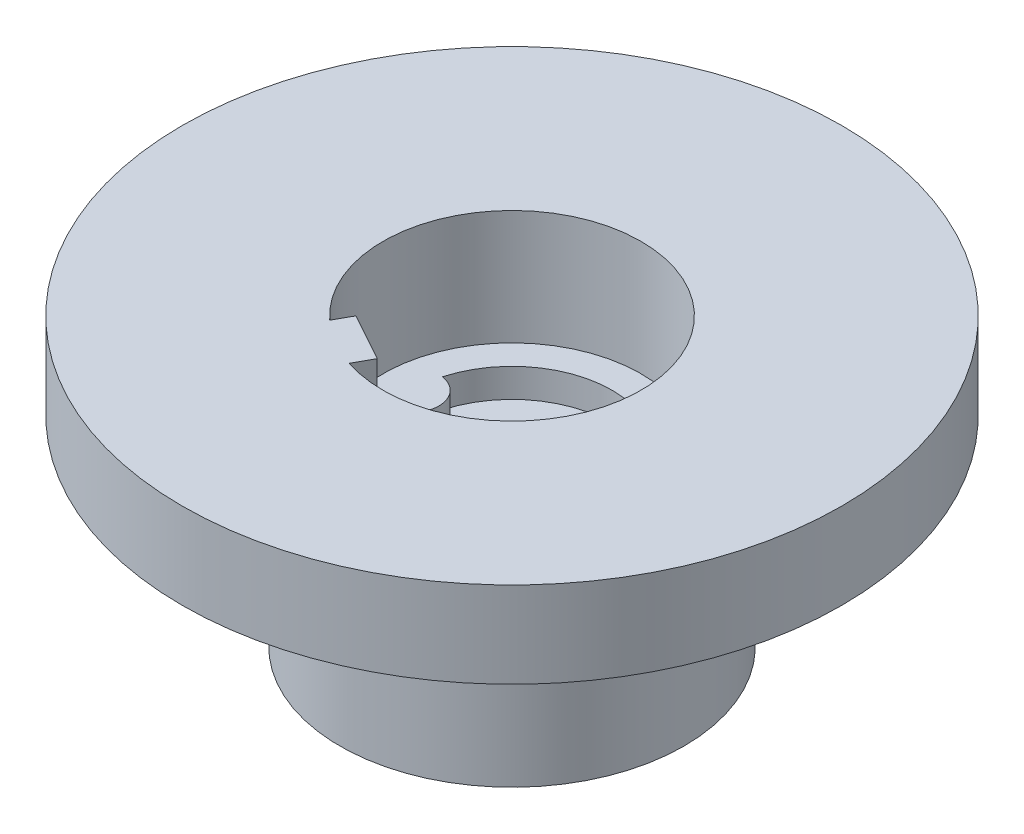
ISO-10303-21;
HEADER;
FILE_DESCRIPTION(('STEP AP214'),'2;1');
FILE_NAME('part.step','',(''),(''),'','','');
FILE_SCHEMA(('AUTOMOTIVE_DESIGN { 1 0 10303 214 1 1 1 1 }'));
ENDSEC;
DATA;
#1=APPLICATION_CONTEXT('core data for automotive mechanical design processes');
#2=APPLICATION_PROTOCOL_DEFINITION('international standard','automotive_design',2000,#1);
#3=PRODUCT_CONTEXT('',#1,'mechanical');
#4=PRODUCT('Part','Part','',(#3));
#5=PRODUCT_RELATED_PRODUCT_CATEGORY('part','',(#4));
#6=PRODUCT_DEFINITION_FORMATION('','',#4);
#7=PRODUCT_DEFINITION_CONTEXT('part definition',#1,'design');
#8=PRODUCT_DEFINITION('design','',#6,#7);
#9=PRODUCT_DEFINITION_SHAPE('','',#8);
#10=(LENGTH_UNIT() NAMED_UNIT(*) SI_UNIT(.MILLI.,.METRE.));
#11=(NAMED_UNIT(*) PLANE_ANGLE_UNIT() SI_UNIT($,.RADIAN.));
#12=(NAMED_UNIT(*) SI_UNIT($,.STERADIAN.) SOLID_ANGLE_UNIT());
#13=UNCERTAINTY_MEASURE_WITH_UNIT(LENGTH_MEASURE(1.E-05),#10,'distance_accuracy_value','');
#14=(GEOMETRIC_REPRESENTATION_CONTEXT(3) GLOBAL_UNCERTAINTY_ASSIGNED_CONTEXT((#13)) GLOBAL_UNIT_ASSIGNED_CONTEXT((#10,
#11,#12)) REPRESENTATION_CONTEXT('',''));
#15=CARTESIAN_POINT('',(0.,0.,0.));
#16=DIRECTION('',(0.,0.,1.));
#17=DIRECTION('',(1.,0.,0.));
#18=AXIS2_PLACEMENT_3D('',#15,#16,#17);
#19=CARTESIAN_POINT('',(0.,0.,0.));
#20=DIRECTION('',(0.,1.,0.));
#21=DIRECTION('',(1.,0.,0.));
#22=AXIS2_PLACEMENT_3D('',#19,#20,#21);
#23=CYLINDRICAL_SURFACE('',#22,3.5);
#24=CARTESIAN_POINT('',(0.,0.,0.));
#25=DIRECTION('',(0.,-1.,0.));
#26=DIRECTION('',(1.,0.,0.));
#27=AXIS2_PLACEMENT_3D('',#24,#25,#26);
#28=CIRCLE('',#27,3.5);
#29=CARTESIAN_POINT('',(2.50064801796052,0.,-2.44882818716833));
#30=VERTEX_POINT('',#29);
#31=CARTESIAN_POINT('',(2.50064801796051,0.,2.44882818716833));
#32=VERTEX_POINT('',#31);
#33=EDGE_CURVE('E203',#30,#32,#28,.T.);
#34=ORIENTED_EDGE('',*,*,#33,.T.);
#35=DIRECTION('',(0.,1.,0.));
#36=VECTOR('',#35,1.);
#37=CARTESIAN_POINT('',(2.50064801796051,0.,2.44882818716833));
#38=LINE('',#37,#36);
#39=CARTESIAN_POINT('',(2.50064801796051,1.,2.44882818716833));
#40=VERTEX_POINT('',#39);
#41=EDGE_CURVE('E11',#32,#40,#38,.T.);
#42=ORIENTED_EDGE('',*,*,#41,.T.);
#43=CARTESIAN_POINT('',(0.,1.,0.));
#44=DIRECTION('',(0.,-1.,0.));
#45=DIRECTION('',(1.,0.,0.));
#46=AXIS2_PLACEMENT_3D('',#43,#44,#45);
#47=CIRCLE('',#46,3.5);
#48=CARTESIAN_POINT('',(2.50064801796052,1.,-2.44882818716833));
#49=VERTEX_POINT('',#48);
#50=EDGE_CURVE('E176',#49,#40,#47,.T.);
#51=ORIENTED_EDGE('',*,*,#50,.F.);
#52=DIRECTION('',(0.,1.,0.));
#53=VECTOR('',#52,1.);
#54=CARTESIAN_POINT('',(2.50064801796052,0.,-2.44882818716833));
#55=LINE('',#54,#53);
#56=EDGE_CURVE('E257',#30,#49,#55,.T.);
#57=ORIENTED_EDGE('',*,*,#56,.F.);
#58=EDGE_LOOP('',(#34,#42,#51,#57));
#59=FACE_BOUND('',#58,.T.);
#60=ADVANCED_FACE('F17',(#59),#23,.F.);
#61=CARTESIAN_POINT('',(1.75,0.,3.03108891324554));
#62=DIRECTION('',(0.,1.,0.));
#63=DIRECTION('',(-1.,0.,0.));
#64=AXIS2_PLACEMENT_3D('',#61,#62,#63);
#65=CYLINDRICAL_SURFACE('',#64,0.95);
#66=CARTESIAN_POINT('',(1.75,0.,3.03108891324554));
#67=DIRECTION('',(0.,1.,0.));
#68=DIRECTION('',(-1.,0.,0.));
#69=AXIS2_PLACEMENT_3D('',#66,#67,#68);
#70=CIRCLE('',#69,0.95);
#71=CARTESIAN_POINT('',(0.870423410610912,0.,3.39003880306118));
#72=VERTEX_POINT('',#71);
#73=EDGE_CURVE('E208',#32,#72,#70,.T.);
#74=ORIENTED_EDGE('',*,*,#73,.T.);
#75=DIRECTION('',(0.,1.,0.));
#76=VECTOR('',#75,1.);
#77=CARTESIAN_POINT('',(0.870423410610912,0.,3.39003880306118));
#78=LINE('',#77,#76);
#79=CARTESIAN_POINT('',(0.870423410610912,1.,3.39003880306118));
#80=VERTEX_POINT('',#79);
#81=EDGE_CURVE('E27',#72,#80,#78,.T.);
#82=ORIENTED_EDGE('',*,*,#81,.T.);
#83=CARTESIAN_POINT('',(1.75,1.,3.03108891324554));
#84=DIRECTION('',(0.,1.,0.));
#85=DIRECTION('',(-1.,0.,0.));
#86=AXIS2_PLACEMENT_3D('',#83,#84,#85);
#87=CIRCLE('',#86,0.95);
#88=EDGE_CURVE('E180',#40,#80,#87,.T.);
#89=ORIENTED_EDGE('',*,*,#88,.F.);
#90=ORIENTED_EDGE('',*,*,#41,.F.);
#91=EDGE_LOOP('',(#74,#82,#89,#90));
#92=FACE_BOUND('',#91,.T.);
#93=ADVANCED_FACE('F300',(#92),#65,.T.);
#94=CARTESIAN_POINT('',(0.,0.,0.));
#95=DIRECTION('',(0.,1.,0.));
#96=DIRECTION('',(1.,0.,0.));
#97=AXIS2_PLACEMENT_3D('',#94,#95,#96);
#98=CYLINDRICAL_SURFACE('',#97,3.5);
#99=CARTESIAN_POINT('',(0.,0.,0.));
#100=DIRECTION('',(0.,-1.,0.));
#101=DIRECTION('',(1.,0.,0.));
#102=AXIS2_PLACEMENT_3D('',#99,#100,#101);
#103=CIRCLE('',#102,3.5);
#104=CARTESIAN_POINT('',(-3.37107142857143,0.,0.941210615892844));
#105=VERTEX_POINT('',#104);
#106=EDGE_CURVE('E217',#72,#105,#103,.T.);
#107=ORIENTED_EDGE('',*,*,#106,.T.);
#108=DIRECTION('',(0.,1.,0.));
#109=VECTOR('',#108,1.);
#110=CARTESIAN_POINT('',(-3.37107142857143,0.,0.941210615892844));
#111=LINE('',#110,#109);
#112=CARTESIAN_POINT('',(-3.37107142857143,1.,0.941210615892844));
#113=VERTEX_POINT('',#112);
#114=EDGE_CURVE('E193',#105,#113,#111,.T.);
#115=ORIENTED_EDGE('',*,*,#114,.T.);
#116=CARTESIAN_POINT('',(0.,1.,0.));
#117=DIRECTION('',(0.,-1.,0.));
#118=DIRECTION('',(1.,0.,0.));
#119=AXIS2_PLACEMENT_3D('',#116,#117,#118);
#120=CIRCLE('',#119,3.5);
#121=EDGE_CURVE('E189',#80,#113,#120,.T.);
#122=ORIENTED_EDGE('',*,*,#121,.F.);
#123=ORIENTED_EDGE('',*,*,#81,.F.);
#124=EDGE_LOOP('',(#107,#115,#122,#123));
#125=FACE_BOUND('',#124,.T.);
#126=ADVANCED_FACE('F19',(#125),#98,.F.);
#127=CARTESIAN_POINT('',(-3.5,0.,0.));
#128=DIRECTION('',(0.,1.,0.));
#129=DIRECTION('',(1.,0.,0.));
#130=AXIS2_PLACEMENT_3D('',#127,#128,#129);
#131=CYLINDRICAL_SURFACE('',#130,0.95);
#132=CARTESIAN_POINT('',(-3.5,0.,0.));
#133=DIRECTION('',(0.,1.,0.));
#134=DIRECTION('',(-1.,0.,0.));
#135=AXIS2_PLACEMENT_3D('',#132,#133,#134);
#136=CIRCLE('',#135,0.95);
#137=CARTESIAN_POINT('',(-3.37107142857143,0.,-0.941210615892846));
#138=VERTEX_POINT('',#137);
#139=EDGE_CURVE('E213',#105,#138,#136,.T.);
#140=ORIENTED_EDGE('',*,*,#139,.T.);
#141=DIRECTION('',(0.,1.,0.));
#142=VECTOR('',#141,1.);
#143=CARTESIAN_POINT('',(-3.37107142857143,0.,-0.941210615892846));
#144=LINE('',#143,#142);
#145=CARTESIAN_POINT('',(-3.37107142857143,1.,-0.941210615892846));
#146=VERTEX_POINT('',#145);
#147=EDGE_CURVE('E190',#138,#146,#144,.T.);
#148=ORIENTED_EDGE('',*,*,#147,.T.);
#149=CARTESIAN_POINT('',(-3.5,1.,0.));
#150=DIRECTION('',(0.,1.,0.));
#151=DIRECTION('',(-1.,0.,0.));
#152=AXIS2_PLACEMENT_3D('',#149,#150,#151);
#153=CIRCLE('',#152,0.95);
#154=EDGE_CURVE('E227',#113,#146,#153,.T.);
#155=ORIENTED_EDGE('',*,*,#154,.F.);
#156=ORIENTED_EDGE('',*,*,#114,.F.);
#157=EDGE_LOOP('',(#140,#148,#155,#156));
#158=FACE_BOUND('',#157,.T.);
#159=ADVANCED_FACE('F311',(#158),#131,.T.);
#160=CARTESIAN_POINT('',(0.,0.,0.));
#161=DIRECTION('',(0.,1.,0.));
#162=DIRECTION('',(1.,0.,0.));
#163=AXIS2_PLACEMENT_3D('',#160,#161,#162);
#164=CYLINDRICAL_SURFACE('',#163,3.5);
#165=CARTESIAN_POINT('',(0.,0.,0.));
#166=DIRECTION('',(0.,-1.,0.));
#167=DIRECTION('',(1.,0.,0.));
#168=AXIS2_PLACEMENT_3D('',#165,#166,#167);
#169=CIRCLE('',#168,3.5);
#170=CARTESIAN_POINT('',(0.870423410610915,0.,-3.39003880306118));
#171=VERTEX_POINT('',#170);
#172=EDGE_CURVE('E171',#138,#171,#169,.T.);
#173=ORIENTED_EDGE('',*,*,#172,.T.);
#174=DIRECTION('',(0.,1.,0.));
#175=VECTOR('',#174,1.);
#176=CARTESIAN_POINT('',(0.870423410610915,0.,-3.39003880306118));
#177=LINE('',#176,#175);
#178=CARTESIAN_POINT('',(0.870423410610914,1.,-3.39003880306118));
#179=VERTEX_POINT('',#178);
#180=EDGE_CURVE('E194',#171,#179,#177,.T.);
#181=ORIENTED_EDGE('',*,*,#180,.T.);
#182=CARTESIAN_POINT('',(0.,1.,0.));
#183=DIRECTION('',(0.,-1.,0.));
#184=DIRECTION('',(1.,0.,0.));
#185=AXIS2_PLACEMENT_3D('',#182,#183,#184);
#186=CIRCLE('',#185,3.5);
#187=EDGE_CURVE('E222',#146,#179,#186,.T.);
#188=ORIENTED_EDGE('',*,*,#187,.F.);
#189=ORIENTED_EDGE('',*,*,#147,.F.);
#190=EDGE_LOOP('',(#173,#181,#188,#189));
#191=FACE_BOUND('',#190,.T.);
#192=ADVANCED_FACE('F335',(#191),#164,.F.);
#193=CARTESIAN_POINT('',(1.75,0.,-3.03108891324553));
#194=DIRECTION('',(0.,1.,0.));
#195=DIRECTION('',(-1.,0.,0.));
#196=AXIS2_PLACEMENT_3D('',#193,#194,#195);
#197=CYLINDRICAL_SURFACE('',#196,0.95);
#198=CARTESIAN_POINT('',(1.75,0.,-3.03108891324553));
#199=DIRECTION('',(0.,1.,0.));
#200=DIRECTION('',(-1.,0.,0.));
#201=AXIS2_PLACEMENT_3D('',#198,#199,#200);
#202=CIRCLE('',#201,0.95);
#203=EDGE_CURVE('E245',#171,#30,#202,.T.);
#204=ORIENTED_EDGE('',*,*,#203,.T.);
#205=ORIENTED_EDGE('',*,*,#56,.T.);
#206=CARTESIAN_POINT('',(1.75,1.,-3.03108891324553));
#207=DIRECTION('',(0.,1.,0.));
#208=DIRECTION('',(-1.,0.,0.));
#209=AXIS2_PLACEMENT_3D('',#206,#207,#208);
#210=CIRCLE('',#209,0.95);
#211=EDGE_CURVE('E226',#179,#49,#210,.T.);
#212=ORIENTED_EDGE('',*,*,#211,.F.);
#213=ORIENTED_EDGE('',*,*,#180,.F.);
#214=EDGE_LOOP('',(#204,#205,#212,#213));
#215=FACE_BOUND('',#214,.T.);
#216=ADVANCED_FACE('F336',(#215),#197,.T.);
#217=CARTESIAN_POINT('',(0.,-5.,0.));
#218=DIRECTION('',(0.,-1.,0.));
#219=DIRECTION('',(0.,0.,-1.));
#220=AXIS2_PLACEMENT_3D('',#217,#218,#219);
#221=PLANE('',#220);
#222=CARTESIAN_POINT('',(0.,-5.,0.));
#223=DIRECTION('',(0.,1.,0.));
#224=DIRECTION('',(-1.,0.,0.));
#225=AXIS2_PLACEMENT_3D('',#222,#223,#224);
#226=CIRCLE('',#225,1.5);
#227=CARTESIAN_POINT('',(1.5,-5.,0.));
#228=VERTEX_POINT('',#227);
#229=EDGE_CURVE('E221',#228,#228,#226,.T.);
#230=ORIENTED_EDGE('',*,*,#229,.T.);
#231=EDGE_LOOP('',(#230));
#232=FACE_BOUND('',#231,.T.);
#233=CARTESIAN_POINT('',(0.,-5.,0.));
#234=DIRECTION('',(0.,-1.,0.));
#235=DIRECTION('',(1.,0.,0.));
#236=AXIS2_PLACEMENT_3D('',#233,#234,#235);
#237=CIRCLE('',#236,6.);
#238=CARTESIAN_POINT('',(-6.,-5.,0.));
#239=VERTEX_POINT('',#238);
#240=EDGE_CURVE('E228',#239,#239,#237,.T.);
#241=ORIENTED_EDGE('',*,*,#240,.T.);
#242=EDGE_LOOP('',(#241));
#243=FACE_BOUND('',#242,.T.);
#244=ADVANCED_FACE('F347',(#232,#243),#221,.T.);
#245=CARTESIAN_POINT('',(0.,0.,0.));
#246=DIRECTION('',(0.,-1.,0.));
#247=DIRECTION('',(1.,0.,0.));
#248=AXIS2_PLACEMENT_3D('',#245,#246,#247);
#249=CYLINDRICAL_SURFACE('',#248,6.);
#250=ORIENTED_EDGE('',*,*,#240,.F.);
#251=DIRECTION('',(0.,1.,0.));
#252=VECTOR('',#251,1.);
#253=CARTESIAN_POINT('',(-6.,0.,0.));
#254=LINE('',#253,#252);
#255=CARTESIAN_POINT('',(-6.,2.,0.));
#256=VERTEX_POINT('',#255);
#257=EDGE_CURVE('E40',#239,#256,#254,.T.);
#258=ORIENTED_EDGE('',*,*,#257,.T.);
#259=CARTESIAN_POINT('',(0.,2.,0.));
#260=DIRECTION('',(0.,-1.,0.));
#261=DIRECTION('',(1.,0.,0.));
#262=AXIS2_PLACEMENT_3D('',#259,#260,#261);
#263=CIRCLE('',#262,6.);
#264=EDGE_CURVE('E256',#256,#256,#263,.T.);
#265=ORIENTED_EDGE('',*,*,#264,.T.);
#266=ORIENTED_EDGE('',*,*,#257,.F.);
#267=EDGE_LOOP('',(#250,#258,#265,#266));
#268=FACE_BOUND('',#267,.T.);
#269=ADVANCED_FACE('F362',(#268),#249,.T.);
#270=CARTESIAN_POINT('',(0.,0.,0.));
#271=DIRECTION('',(0.,-1.,0.));
#272=DIRECTION('',(-1.,0.,0.));
#273=AXIS2_PLACEMENT_3D('',#270,#271,#272);
#274=CYLINDRICAL_SURFACE('',#273,1.5);
#275=ORIENTED_EDGE('',*,*,#229,.F.);
#276=DIRECTION('',(0.,1.,0.));
#277=VECTOR('',#276,1.);
#278=CARTESIAN_POINT('',(1.5,0.,0.));
#279=LINE('',#278,#277);
#280=CARTESIAN_POINT('',(1.5,0.,0.));
#281=VERTEX_POINT('',#280);
#282=EDGE_CURVE('E231',#228,#281,#279,.T.);
#283=ORIENTED_EDGE('',*,*,#282,.T.);
#284=CARTESIAN_POINT('',(0.,0.,0.));
#285=DIRECTION('',(0.,1.,0.));
#286=DIRECTION('',(-1.,0.,0.));
#287=AXIS2_PLACEMENT_3D('',#284,#285,#286);
#288=CIRCLE('',#287,1.5);
#289=EDGE_CURVE('E207',#281,#281,#288,.T.);
#290=ORIENTED_EDGE('',*,*,#289,.T.);
#291=ORIENTED_EDGE('',*,*,#282,.F.);
#292=EDGE_LOOP('',(#275,#283,#290,#291));
#293=FACE_BOUND('',#292,.T.);
#294=ADVANCED_FACE('F359',(#293),#274,.F.);
#295=CARTESIAN_POINT('',(0.,0.,0.));
#296=DIRECTION('',(0.,-1.,0.));
#297=DIRECTION('',(0.,0.,-1.));
#298=AXIS2_PLACEMENT_3D('',#295,#296,#297);
#299=PLANE('',#298);
#300=ORIENTED_EDGE('',*,*,#289,.F.);
#301=EDGE_LOOP('',(#300));
#302=FACE_BOUND('',#301,.T.);
#303=ORIENTED_EDGE('',*,*,#203,.F.);
#304=ORIENTED_EDGE('',*,*,#172,.F.);
#305=ORIENTED_EDGE('',*,*,#139,.F.);
#306=ORIENTED_EDGE('',*,*,#106,.F.);
#307=ORIENTED_EDGE('',*,*,#73,.F.);
#308=ORIENTED_EDGE('',*,*,#33,.F.);
#309=EDGE_LOOP('',(#303,#304,#305,#306,#307,#308));
#310=FACE_BOUND('',#309,.T.);
#311=ADVANCED_FACE('F307',(#302,#310),#299,.F.);
#312=CARTESIAN_POINT('',(0.,0.,0.));
#313=DIRECTION('',(0.,1.,0.));
#314=DIRECTION('',(0.505803848754404,0.,-0.862648518566648));
#315=AXIS2_PLACEMENT_3D('',#312,#313,#314);
#316=CYLINDRICAL_SURFACE('',#315,4.5);
#317=DIRECTION('',(0.,-1.,0.));
#318=VECTOR('',#317,1.);
#319=CARTESIAN_POINT('',(-3.04456091948507,0.,3.31370620416841));
#320=LINE('',#319,#318);
#321=CARTESIAN_POINT('',(-3.04456091948507,5.,3.31370620416841));
#322=VERTEX_POINT('',#321);
#323=CARTESIAN_POINT('',(-3.04456091948507,1.,3.31370620416841));
#324=VERTEX_POINT('',#323);
#325=EDGE_CURVE('E185',#322,#324,#320,.T.);
#326=ORIENTED_EDGE('',*,*,#325,.T.);
#327=CARTESIAN_POINT('',(0.,1.,0.));
#328=DIRECTION('',(0.,1.,0.));
#329=DIRECTION('',(-1.,0.,0.));
#330=AXIS2_PLACEMENT_3D('',#327,#328,#329);
#331=CIRCLE('',#330,4.5);
#332=CARTESIAN_POINT('',(-1.40501008374635,1.,4.27503762142172));
#333=VERTEX_POINT('',#332);
#334=EDGE_CURVE('E181',#333,#324,#331,.T.);
#335=ORIENTED_EDGE('',*,*,#334,.F.);
#336=DIRECTION('',(0.,1.,0.));
#337=VECTOR('',#336,1.);
#338=CARTESIAN_POINT('',(-1.40501008374635,0.,4.27503762142172));
#339=LINE('',#338,#337);
#340=CARTESIAN_POINT('',(-1.40501008374635,5.,4.27503762142172));
#341=VERTEX_POINT('',#340);
#342=EDGE_CURVE('E145',#333,#341,#339,.T.);
#343=ORIENTED_EDGE('',*,*,#342,.T.);
#344=CARTESIAN_POINT('',(0.,5.,0.));
#345=DIRECTION('',(0.,-1.,0.));
#346=DIRECTION('',(-1.,0.,0.));
#347=AXIS2_PLACEMENT_3D('',#344,#345,#346);
#348=CIRCLE('',#347,4.5);
#349=EDGE_CURVE('E140',#322,#341,#348,.T.);
#350=ORIENTED_EDGE('',*,*,#349,.F.);
#351=EDGE_LOOP('',(#326,#335,#343,#350));
#352=FACE_BOUND('',#351,.T.);
#353=ADVANCED_FACE('F269',(#352),#316,.F.);
#354=CARTESIAN_POINT('',(0.,1.,0.));
#355=DIRECTION('',(0.,1.,0.));
#356=DIRECTION('',(1.,0.,0.));
#357=AXIS2_PLACEMENT_3D('',#354,#355,#356);
#358=PLANE('',#357);
#359=ORIENTED_EDGE('',*,*,#50,.T.);
#360=ORIENTED_EDGE('',*,*,#88,.T.);
#361=ORIENTED_EDGE('',*,*,#121,.T.);
#362=ORIENTED_EDGE('',*,*,#154,.T.);
#363=ORIENTED_EDGE('',*,*,#187,.T.);
#364=ORIENTED_EDGE('',*,*,#211,.T.);
#365=EDGE_LOOP('',(#359,#360,#361,#362,#363,#364));
#366=FACE_BOUND('',#365,.T.);
#367=DIRECTION('',(0.483947354786999,0.,-0.875097113350665));
#368=VECTOR('',#367,1.);
#369=CARTESIAN_POINT('',(-2.35713014828847,1.,2.07066049361309));
#370=LINE('',#369,#368);
#371=CARTESIAN_POINT('',(-2.7192616310654,1.,2.72548423032091));
#372=VERTEX_POINT('',#371);
#373=EDGE_CURVE('E200',#324,#372,#370,.T.);
#374=ORIENTED_EDGE('',*,*,#373,.T.);
#375=DIRECTION('',(0.875097113350664,0.,0.483947354787));
#376=VECTOR('',#375,1.);
#377=CARTESIAN_POINT('',(-2.25518576553297,1.,2.98212807489375));
#378=LINE('',#377,#376);
#379=CARTESIAN_POINT('',(-1.05657711569913,1.,3.64498420441621));
#380=VERTEX_POINT('',#379);
#381=EDGE_CURVE('E162',#372,#380,#378,.T.);
#382=ORIENTED_EDGE('',*,*,#381,.T.);
#383=DIRECTION('',(-0.483947354786999,0.,0.875097113350665));
#384=VECTOR('',#383,1.);
#385=CARTESIAN_POINT('',(-0.161022165698866,1.,2.02559824468292));
#386=LINE('',#385,#384);
#387=EDGE_CURVE('E146',#380,#333,#386,.T.);
#388=ORIENTED_EDGE('',*,*,#387,.T.);
#389=ORIENTED_EDGE('',*,*,#334,.T.);
#390=EDGE_LOOP('',(#374,#382,#388,#389));
#391=FACE_BOUND('',#390,.T.);
#392=ADVANCED_FACE('F272',(#366,#391),#358,.T.);
#393=CARTESIAN_POINT('',(0.,5.,0.));
#394=DIRECTION('',(0.,1.,0.));
#395=DIRECTION('',(1.,0.,0.));
#396=AXIS2_PLACEMENT_3D('',#393,#394,#395);
#397=PLANE('',#396);
#398=ORIENTED_EDGE('',*,*,#349,.T.);
#399=DIRECTION('',(0.483947354786999,0.,-0.875097113350665));
#400=VECTOR('',#399,1.);
#401=CARTESIAN_POINT('',(-3.28073836893461,5.,7.66682061509235));
#402=LINE('',#401,#400);
#403=CARTESIAN_POINT('',(-1.05657711569913,5.,3.64498420441621));
#404=VERTEX_POINT('',#403);
#405=EDGE_CURVE('E133',#341,#404,#402,.T.);
#406=ORIENTED_EDGE('',*,*,#405,.T.);
#407=DIRECTION('',(-0.875097113350664,0.,-0.483947354787));
#408=VECTOR('',#407,1.);
#409=CARTESIAN_POINT('',(-1.05657711569913,5.,3.64498420441621));
#410=LINE('',#409,#408);
#411=CARTESIAN_POINT('',(-2.7192616310654,5.,2.72548423032091));
#412=VERTEX_POINT('',#411);
#413=EDGE_CURVE('E138',#404,#412,#410,.T.);
#414=ORIENTED_EDGE('',*,*,#413,.T.);
#415=DIRECTION('',(-0.483947354786999,0.,0.875097113350665));
#416=VECTOR('',#415,1.);
#417=CARTESIAN_POINT('',(-2.7192616310654,5.,2.72548423032091));
#418=LINE('',#417,#416);
#419=EDGE_CURVE('E182',#412,#322,#418,.T.);
#420=ORIENTED_EDGE('',*,*,#419,.T.);
#421=EDGE_LOOP('',(#398,#406,#414,#420));
#422=FACE_BOUND('',#421,.T.);
#423=CARTESIAN_POINT('',(0.,5.,0.));
#424=DIRECTION('',(0.,1.,0.));
#425=DIRECTION('',(1.,0.,0.));
#426=AXIS2_PLACEMENT_3D('',#423,#424,#425);
#427=CIRCLE('',#426,11.5);
#428=CARTESIAN_POINT('',(-11.5,5.,0.));
#429=VERTEX_POINT('',#428);
#430=EDGE_CURVE('E68',#429,#429,#427,.T.);
#431=ORIENTED_EDGE('',*,*,#430,.T.);
#432=EDGE_LOOP('',(#431));
#433=FACE_BOUND('',#432,.T.);
#434=ADVANCED_FACE('F135',(#422,#433),#397,.T.);
#435=CARTESIAN_POINT('',(-1.05657711569913,5.,3.64498420441621));
#436=DIRECTION('',(0.875097113350665,0.,0.483947354786999));
#437=DIRECTION('',(0.,-1.,0.));
#438=AXIS2_PLACEMENT_3D('',#435,#436,#437);
#439=PLANE('',#438);
#440=ORIENTED_EDGE('',*,*,#387,.F.);
#441=DIRECTION('',(0.,-1.,0.));
#442=VECTOR('',#441,1.);
#443=CARTESIAN_POINT('',(-1.05657711569913,5.,3.64498420441621));
#444=LINE('',#443,#442);
#445=EDGE_CURVE('E149',#404,#380,#444,.T.);
#446=ORIENTED_EDGE('',*,*,#445,.F.);
#447=ORIENTED_EDGE('',*,*,#405,.F.);
#448=ORIENTED_EDGE('',*,*,#342,.F.);
#449=EDGE_LOOP('',(#440,#446,#447,#448));
#450=FACE_BOUND('',#449,.T.);
#451=ADVANCED_FACE('F150',(#450),#439,.T.);
#452=CARTESIAN_POINT('',(-2.7192616310654,5.,2.72548423032091));
#453=DIRECTION('',(0.483947354787,0.,-0.875097113350665));
#454=DIRECTION('',(0.,-1.,0.));
#455=AXIS2_PLACEMENT_3D('',#452,#453,#454);
#456=PLANE('',#455);
#457=ORIENTED_EDGE('',*,*,#381,.F.);
#458=DIRECTION('',(0.,-1.,0.));
#459=VECTOR('',#458,1.);
#460=CARTESIAN_POINT('',(-2.7192616310654,5.,2.72548423032091));
#461=LINE('',#460,#459);
#462=EDGE_CURVE('E159',#412,#372,#461,.T.);
#463=ORIENTED_EDGE('',*,*,#462,.F.);
#464=ORIENTED_EDGE('',*,*,#413,.F.);
#465=ORIENTED_EDGE('',*,*,#445,.T.);
#466=EDGE_LOOP('',(#457,#463,#464,#465));
#467=FACE_BOUND('',#466,.T.);
#468=ADVANCED_FACE('F157',(#467),#456,.T.);
#469=CARTESIAN_POINT('',(-3.78610856551207,5.,4.65460867637185));
#470=DIRECTION('',(-0.875097113350665,0.,-0.483947354786999));
#471=DIRECTION('',(-0.483947354786999,0.,0.875097113350665));
#472=AXIS2_PLACEMENT_3D('',#469,#470,#471);
#473=PLANE('',#472);
#474=ORIENTED_EDGE('',*,*,#373,.F.);
#475=ORIENTED_EDGE('',*,*,#325,.F.);
#476=ORIENTED_EDGE('',*,*,#419,.F.);
#477=ORIENTED_EDGE('',*,*,#462,.T.);
#478=EDGE_LOOP('',(#474,#475,#476,#477));
#479=FACE_BOUND('',#478,.T.);
#480=ADVANCED_FACE('F275',(#479),#473,.T.);
#481=CARTESIAN_POINT('',(0.,2.,0.));
#482=DIRECTION('',(0.,1.,0.));
#483=DIRECTION('',(1.,0.,0.));
#484=AXIS2_PLACEMENT_3D('',#481,#482,#483);
#485=PLANE('',#484);
#486=ORIENTED_EDGE('',*,*,#264,.F.);
#487=EDGE_LOOP('',(#486));
#488=FACE_BOUND('',#487,.T.);
#489=CARTESIAN_POINT('',(0.,2.,0.));
#490=DIRECTION('',(0.,-1.,0.));
#491=DIRECTION('',(1.,0.,0.));
#492=AXIS2_PLACEMENT_3D('',#489,#490,#491);
#493=CIRCLE('',#492,11.5);
#494=CARTESIAN_POINT('',(-11.5,2.,0.));
#495=VERTEX_POINT('',#494);
#496=EDGE_CURVE('E173',#495,#495,#493,.T.);
#497=ORIENTED_EDGE('',*,*,#496,.T.);
#498=EDGE_LOOP('',(#497));
#499=FACE_BOUND('',#498,.T.);
#500=ADVANCED_FACE('F350',(#488,#499),#485,.F.);
#501=CARTESIAN_POINT('',(0.,5.,0.));
#502=DIRECTION('',(0.,-1.,0.));
#503=DIRECTION('',(1.,0.,0.));
#504=AXIS2_PLACEMENT_3D('',#501,#502,#503);
#505=CYLINDRICAL_SURFACE('',#504,11.5);
#506=ORIENTED_EDGE('',*,*,#496,.F.);
#507=DIRECTION('',(0.,1.,0.));
#508=VECTOR('',#507,1.);
#509=CARTESIAN_POINT('',(-11.5,5.,0.));
#510=LINE('',#509,#508);
#511=EDGE_CURVE('E79',#495,#429,#510,.T.);
#512=ORIENTED_EDGE('',*,*,#511,.T.);
#513=ORIENTED_EDGE('',*,*,#430,.F.);
#514=ORIENTED_EDGE('',*,*,#511,.F.);
#515=EDGE_LOOP('',(#506,#512,#513,#514));
#516=FACE_BOUND('',#515,.T.);
#517=ADVANCED_FACE('F353',(#516),#505,.T.);
#518=CLOSED_SHELL('',(#60,#93,#126,#159,#192,#216,#244,#269,#294,#311,#353,#392,#434,#451,#468,
#480,#500,#517));
#519=MANIFOLD_SOLID_BREP('B1',#518);
#520=ADVANCED_BREP_SHAPE_REPRESENTATION('',(#18,#519),#14);
#521=SHAPE_DEFINITION_REPRESENTATION(#9,#520);
ENDSEC;
END-ISO-10303-21;
